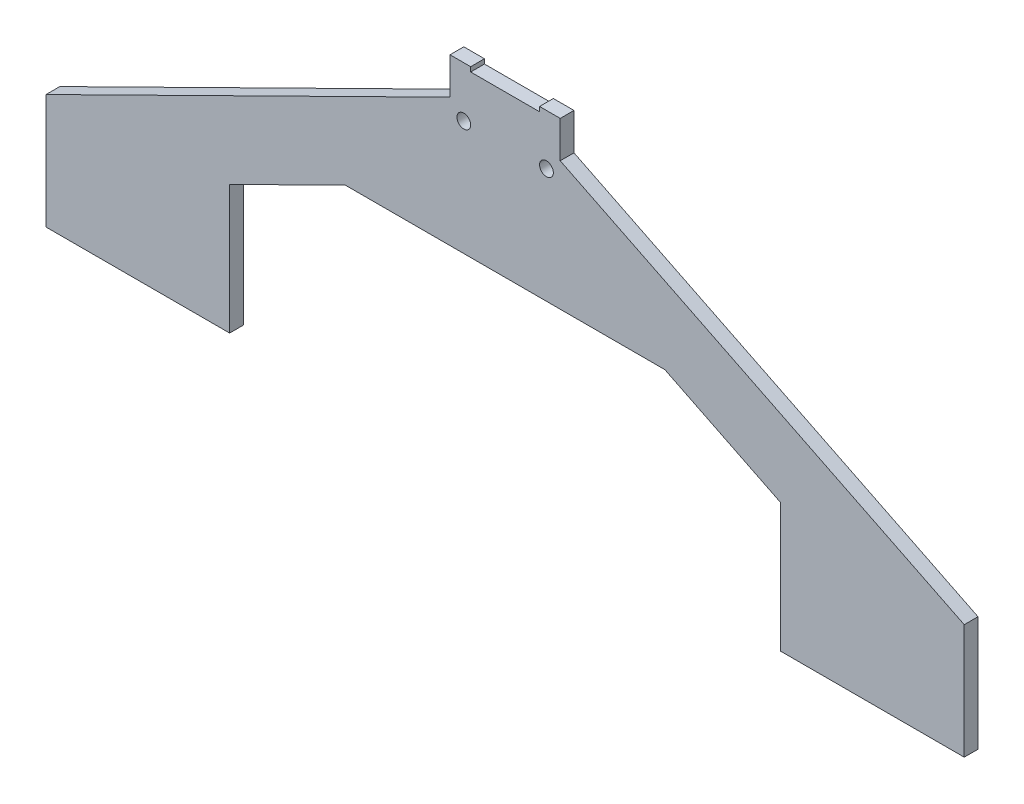
ISO-10303-21;
HEADER;
FILE_DESCRIPTION(('STEP AP214'),'2;1');
FILE_NAME('part.step','',(''),(''),'','','');
FILE_SCHEMA(('AUTOMOTIVE_DESIGN { 1 0 10303 214 1 1 1 1 }'));
ENDSEC;
DATA;
#1=APPLICATION_CONTEXT('core data for automotive mechanical design processes');
#2=APPLICATION_PROTOCOL_DEFINITION('international standard','automotive_design',2000,#1);
#3=PRODUCT_CONTEXT('',#1,'mechanical');
#4=PRODUCT('Part','Part','',(#3));
#5=PRODUCT_RELATED_PRODUCT_CATEGORY('part','',(#4));
#6=PRODUCT_DEFINITION_FORMATION('','',#4);
#7=PRODUCT_DEFINITION_CONTEXT('part definition',#1,'design');
#8=PRODUCT_DEFINITION('design','',#6,#7);
#9=PRODUCT_DEFINITION_SHAPE('','',#8);
#10=(LENGTH_UNIT() NAMED_UNIT(*) SI_UNIT(.MILLI.,.METRE.));
#11=(NAMED_UNIT(*) PLANE_ANGLE_UNIT() SI_UNIT($,.RADIAN.));
#12=(NAMED_UNIT(*) SI_UNIT($,.STERADIAN.) SOLID_ANGLE_UNIT());
#13=UNCERTAINTY_MEASURE_WITH_UNIT(LENGTH_MEASURE(1.E-05),#10,'distance_accuracy_value','');
#14=(GEOMETRIC_REPRESENTATION_CONTEXT(3) GLOBAL_UNCERTAINTY_ASSIGNED_CONTEXT((#13)) GLOBAL_UNIT_ASSIGNED_CONTEXT((#10,
#11,#12)) REPRESENTATION_CONTEXT('',''));
#15=CARTESIAN_POINT('',(0.,0.,0.));
#16=DIRECTION('',(0.,0.,1.));
#17=DIRECTION('',(1.,0.,0.));
#18=AXIS2_PLACEMENT_3D('',#15,#16,#17);
#19=CARTESIAN_POINT('',(-7.50000000000006,0.999999999991008,-3030.98121824954));
#20=DIRECTION('',(-1.,0.,0.));
#21=DIRECTION('',(0.,-1.,0.));
#22=AXIS2_PLACEMENT_3D('',#19,#20,#21);
#23=PLANE('',#22);
#24=DIRECTION('',(0.,1.,0.));
#25=VECTOR('',#24,1.);
#26=CARTESIAN_POINT('',(-7.50000000000006,0.999999999991008,-3033.98121824954));
#27=LINE('',#26,#25);
#28=CARTESIAN_POINT('',(-7.50000000000012,-8.88178419700125E-12,-3033.98121824954));
#29=VERTEX_POINT('',#28);
#30=CARTESIAN_POINT('',(-7.50000000000006,0.999999999991008,-3033.98121824954));
#31=VERTEX_POINT('',#30);
#32=EDGE_CURVE('E191',#29,#31,#27,.T.);
#33=ORIENTED_EDGE('',*,*,#32,.T.);
#34=DIRECTION('',(0.,0.,-1.));
#35=VECTOR('',#34,1.);
#36=CARTESIAN_POINT('',(-7.50000000000006,0.999999999991008,-3030.98121824954));
#37=LINE('',#36,#35);
#38=CARTESIAN_POINT('',(-7.50000000000006,0.999999999991008,-3030.98121824954));
#39=VERTEX_POINT('',#38);
#40=EDGE_CURVE('E11',#39,#31,#37,.T.);
#41=ORIENTED_EDGE('',*,*,#40,.F.);
#42=DIRECTION('',(0.,1.,0.));
#43=VECTOR('',#42,1.);
#44=CARTESIAN_POINT('',(-7.50000000000006,0.999999999991008,-3030.98121824954));
#45=LINE('',#44,#43);
#46=CARTESIAN_POINT('',(-7.50000000000012,-8.88178419700125E-12,-3030.98121824954));
#47=VERTEX_POINT('',#46);
#48=EDGE_CURVE('E226',#47,#39,#45,.T.);
#49=ORIENTED_EDGE('',*,*,#48,.F.);
#50=DIRECTION('',(0.,0.,-1.));
#51=VECTOR('',#50,1.);
#52=CARTESIAN_POINT('',(-7.50000000000012,-8.88178419700125E-12,-3030.98121824954));
#53=LINE('',#52,#51);
#54=EDGE_CURVE('E187',#47,#29,#53,.T.);
#55=ORIENTED_EDGE('',*,*,#54,.T.);
#56=EDGE_LOOP('',(#33,#41,#49,#55));
#57=FACE_BOUND('',#56,.T.);
#58=ADVANCED_FACE('F35',(#57),#23,.F.);
#59=CARTESIAN_POINT('',(-12.0000000000002,0.999999999991008,-3030.98121824954));
#60=DIRECTION('',(0.,-1.,0.));
#61=DIRECTION('',(0.,0.,-1.));
#62=AXIS2_PLACEMENT_3D('',#59,#60,#61);
#63=PLANE('',#62);
#64=DIRECTION('',(-1.,0.,0.));
#65=VECTOR('',#64,1.);
#66=CARTESIAN_POINT('',(-12.0000000000002,0.999999999991008,-3033.98121824954));
#67=LINE('',#66,#65);
#68=CARTESIAN_POINT('',(-12.0000000000002,0.999999999991008,-3033.98121824954));
#69=VERTEX_POINT('',#68);
#70=EDGE_CURVE('E194',#31,#69,#67,.T.);
#71=ORIENTED_EDGE('',*,*,#70,.T.);
#72=DIRECTION('',(0.,0.,-1.));
#73=VECTOR('',#72,1.);
#74=CARTESIAN_POINT('',(-12.0000000000002,0.999999999991008,-3030.98121824954));
#75=LINE('',#74,#73);
#76=CARTESIAN_POINT('',(-12.0000000000002,0.999999999991008,-3030.98121824954));
#77=VERTEX_POINT('',#76);
#78=EDGE_CURVE('E43',#77,#69,#75,.T.);
#79=ORIENTED_EDGE('',*,*,#78,.F.);
#80=DIRECTION('',(-1.,0.,0.));
#81=VECTOR('',#80,1.);
#82=CARTESIAN_POINT('',(-12.0000000000002,0.999999999991008,-3030.98121824954));
#83=LINE('',#82,#81);
#84=EDGE_CURVE('E124',#39,#77,#83,.T.);
#85=ORIENTED_EDGE('',*,*,#84,.F.);
#86=ORIENTED_EDGE('',*,*,#40,.T.);
#87=EDGE_LOOP('',(#71,#79,#85,#86));
#88=FACE_BOUND('',#87,.T.);
#89=ADVANCED_FACE('F335',(#88),#63,.F.);
#90=CARTESIAN_POINT('',(-12.0000000000002,0.999999999991008,-3030.98121824954));
#91=DIRECTION('',(1.,0.,0.));
#92=DIRECTION('',(0.,0.,-1.));
#93=AXIS2_PLACEMENT_3D('',#90,#91,#92);
#94=PLANE('',#93);
#95=DIRECTION('',(0.,-1.,0.));
#96=VECTOR('',#95,1.);
#97=CARTESIAN_POINT('',(-12.0000000000002,0.999999999991008,-3033.98121824954));
#98=LINE('',#97,#96);
#99=CARTESIAN_POINT('',(-12.0000000000002,-7.000000000009,-3033.98121824954));
#100=VERTEX_POINT('',#99);
#101=EDGE_CURVE('E197',#69,#100,#98,.T.);
#102=ORIENTED_EDGE('',*,*,#101,.T.);
#103=DIRECTION('',(0.,0.,-1.));
#104=VECTOR('',#103,1.);
#105=CARTESIAN_POINT('',(-12.0000000000002,-7.000000000009,-3030.98121824954));
#106=LINE('',#105,#104);
#107=CARTESIAN_POINT('',(-12.0000000000002,-7.000000000009,-3030.98121824954));
#108=VERTEX_POINT('',#107);
#109=EDGE_CURVE('E263',#108,#100,#106,.T.);
#110=ORIENTED_EDGE('',*,*,#109,.F.);
#111=DIRECTION('',(0.,-1.,0.));
#112=VECTOR('',#111,1.);
#113=CARTESIAN_POINT('',(-12.0000000000002,0.999999999991008,-3030.98121824954));
#114=LINE('',#113,#112);
#115=EDGE_CURVE('E271',#77,#108,#114,.T.);
#116=ORIENTED_EDGE('',*,*,#115,.F.);
#117=ORIENTED_EDGE('',*,*,#78,.T.);
#118=EDGE_LOOP('',(#102,#110,#116,#117));
#119=FACE_BOUND('',#118,.T.);
#120=ADVANCED_FACE('F269',(#119),#94,.F.);
#121=CARTESIAN_POINT('',(-12.0000000000002,-7.000000000009,-3030.98121824954));
#122=DIRECTION('',(0.443134157673178,-0.896455307476777,0.));
#123=DIRECTION('',(0.896455307476777,0.443134157673178,0.));
#124=AXIS2_PLACEMENT_3D('',#121,#122,#123);
#125=PLANE('',#124);
#126=DIRECTION('',(-0.896455307476777,-0.443134157673178,0.));
#127=VECTOR('',#126,1.);
#128=CARTESIAN_POINT('',(-12.0000000000002,-7.000000000009,-3033.98121824954));
#129=LINE('',#128,#127);
#130=CARTESIAN_POINT('',(-100.,-50.5000000000089,-3033.98121824954));
#131=VERTEX_POINT('',#130);
#132=EDGE_CURVE('E199',#100,#131,#129,.T.);
#133=ORIENTED_EDGE('',*,*,#132,.T.);
#134=DIRECTION('',(0.,0.,-1.));
#135=VECTOR('',#134,1.);
#136=CARTESIAN_POINT('',(-100.,-50.5000000000089,-3030.98121824954));
#137=LINE('',#136,#135);
#138=CARTESIAN_POINT('',(-100.,-50.5000000000089,-3030.98121824954));
#139=VERTEX_POINT('',#138);
#140=EDGE_CURVE('E260',#139,#131,#137,.T.);
#141=ORIENTED_EDGE('',*,*,#140,.F.);
#142=DIRECTION('',(-0.896455307476777,-0.443134157673178,0.));
#143=VECTOR('',#142,1.);
#144=CARTESIAN_POINT('',(-12.0000000000002,-7.000000000009,-3030.98121824954));
#145=LINE('',#144,#143);
#146=EDGE_CURVE('E289',#108,#139,#145,.T.);
#147=ORIENTED_EDGE('',*,*,#146,.F.);
#148=ORIENTED_EDGE('',*,*,#109,.T.);
#149=EDGE_LOOP('',(#133,#141,#147,#148));
#150=FACE_BOUND('',#149,.T.);
#151=ADVANCED_FACE('F280',(#150),#125,.F.);
#152=CARTESIAN_POINT('',(-100.,-50.5000000000089,-3030.98121824954));
#153=DIRECTION('',(1.,0.,0.));
#154=DIRECTION('',(0.,0.,-1.));
#155=AXIS2_PLACEMENT_3D('',#152,#153,#154);
#156=PLANE('',#155);
#157=DIRECTION('',(0.,-1.,0.));
#158=VECTOR('',#157,1.);
#159=CARTESIAN_POINT('',(-100.,-50.5000000000089,-3033.98121824954));
#160=LINE('',#159,#158);
#161=CARTESIAN_POINT('',(-100.,-75.5000000000088,-3033.98121824954));
#162=VERTEX_POINT('',#161);
#163=EDGE_CURVE('E201',#131,#162,#160,.T.);
#164=ORIENTED_EDGE('',*,*,#163,.T.);
#165=DIRECTION('',(0.,0.,-1.));
#166=VECTOR('',#165,1.);
#167=CARTESIAN_POINT('',(-100.,-75.5000000000088,-3030.98121824954));
#168=LINE('',#167,#166);
#169=CARTESIAN_POINT('',(-100.,-75.5000000000088,-3030.98121824954));
#170=VERTEX_POINT('',#169);
#171=EDGE_CURVE('E257',#170,#162,#168,.T.);
#172=ORIENTED_EDGE('',*,*,#171,.F.);
#173=DIRECTION('',(0.,-1.,0.));
#174=VECTOR('',#173,1.);
#175=CARTESIAN_POINT('',(-100.,-50.5000000000089,-3030.98121824954));
#176=LINE('',#175,#174);
#177=EDGE_CURVE('E286',#139,#170,#176,.T.);
#178=ORIENTED_EDGE('',*,*,#177,.F.);
#179=ORIENTED_EDGE('',*,*,#140,.T.);
#180=EDGE_LOOP('',(#164,#172,#178,#179));
#181=FACE_BOUND('',#180,.T.);
#182=ADVANCED_FACE('F284',(#181),#156,.F.);
#183=CARTESIAN_POINT('',(-100.,-75.5000000000088,-3030.98121824954));
#184=DIRECTION('',(0.,1.,0.));
#185=DIRECTION('',(-1.,0.,0.));
#186=AXIS2_PLACEMENT_3D('',#183,#184,#185);
#187=PLANE('',#186);
#188=DIRECTION('',(1.,0.,0.));
#189=VECTOR('',#188,1.);
#190=CARTESIAN_POINT('',(-100.,-75.5000000000088,-3033.98121824954));
#191=LINE('',#190,#189);
#192=CARTESIAN_POINT('',(-60.0000000000001,-75.5000000000092,-3033.98121824954));
#193=VERTEX_POINT('',#192);
#194=EDGE_CURVE('E203',#162,#193,#191,.T.);
#195=ORIENTED_EDGE('',*,*,#194,.T.);
#196=DIRECTION('',(0.,0.,-1.));
#197=VECTOR('',#196,1.);
#198=CARTESIAN_POINT('',(-60.0000000000001,-75.5000000000092,-3030.98121824954));
#199=LINE('',#198,#197);
#200=CARTESIAN_POINT('',(-60.0000000000001,-75.5000000000092,-3030.98121824954));
#201=VERTEX_POINT('',#200);
#202=EDGE_CURVE('E254',#201,#193,#199,.T.);
#203=ORIENTED_EDGE('',*,*,#202,.F.);
#204=DIRECTION('',(1.,0.,0.));
#205=VECTOR('',#204,1.);
#206=CARTESIAN_POINT('',(-100.,-75.5000000000088,-3030.98121824954));
#207=LINE('',#206,#205);
#208=EDGE_CURVE('E288',#170,#201,#207,.T.);
#209=ORIENTED_EDGE('',*,*,#208,.F.);
#210=ORIENTED_EDGE('',*,*,#171,.T.);
#211=EDGE_LOOP('',(#195,#203,#209,#210));
#212=FACE_BOUND('',#211,.T.);
#213=ADVANCED_FACE('F348',(#212),#187,.F.);
#214=CARTESIAN_POINT('',(-60.0000000000001,-75.5000000000092,-3030.98121824954));
#215=DIRECTION('',(-1.,0.,0.));
#216=DIRECTION('',(0.,-1.,0.));
#217=AXIS2_PLACEMENT_3D('',#214,#215,#216);
#218=PLANE('',#217);
#219=DIRECTION('',(0.,1.,0.));
#220=VECTOR('',#219,1.);
#221=CARTESIAN_POINT('',(-60.0000000000001,-75.5000000000092,-3033.98121824954));
#222=LINE('',#221,#220);
#223=CARTESIAN_POINT('',(-60.0000000000001,-47.4598414062668,-3033.98121824954));
#224=VERTEX_POINT('',#223);
#225=EDGE_CURVE('E205',#193,#224,#222,.T.);
#226=ORIENTED_EDGE('',*,*,#225,.T.);
#227=DIRECTION('',(0.,0.,-1.));
#228=VECTOR('',#227,1.);
#229=CARTESIAN_POINT('',(-60.0000000000001,-47.4598414062668,-3030.98121824954));
#230=LINE('',#229,#228);
#231=CARTESIAN_POINT('',(-60.0000000000001,-47.4598414062668,-3030.98121824954));
#232=VERTEX_POINT('',#231);
#233=EDGE_CURVE('E251',#232,#224,#230,.T.);
#234=ORIENTED_EDGE('',*,*,#233,.F.);
#235=DIRECTION('',(0.,1.,0.));
#236=VECTOR('',#235,1.);
#237=CARTESIAN_POINT('',(-60.0000000000001,-75.5000000000092,-3030.98121824954));
#238=LINE('',#237,#236);
#239=EDGE_CURVE('E291',#201,#232,#238,.T.);
#240=ORIENTED_EDGE('',*,*,#239,.F.);
#241=ORIENTED_EDGE('',*,*,#202,.T.);
#242=EDGE_LOOP('',(#226,#234,#240,#241));
#243=FACE_BOUND('',#242,.T.);
#244=ADVANCED_FACE('F351',(#243),#218,.F.);
#245=CARTESIAN_POINT('',(-60.0000000000001,-47.4598414062668,-3030.98121824954));
#246=DIRECTION('',(-0.443134157673177,0.896455307476778,0.));
#247=DIRECTION('',(-0.896455307476778,-0.443134157673177,0.));
#248=AXIS2_PLACEMENT_3D('',#245,#246,#247);
#249=PLANE('',#248);
#250=DIRECTION('',(0.896455307476778,0.443134157673177,0.));
#251=VECTOR('',#250,1.);
#252=CARTESIAN_POINT('',(-60.0000000000001,-47.4598414062668,-3033.98121824954));
#253=LINE('',#252,#251);
#254=CARTESIAN_POINT('',(-34.7938840516993,-35.0000000000046,-3033.98121824954));
#255=VERTEX_POINT('',#254);
#256=EDGE_CURVE('E207',#224,#255,#253,.T.);
#257=ORIENTED_EDGE('',*,*,#256,.T.);
#258=DIRECTION('',(0.,0.,-1.));
#259=VECTOR('',#258,1.);
#260=CARTESIAN_POINT('',(-34.7938840516993,-35.0000000000046,-3030.98121824954));
#261=LINE('',#260,#259);
#262=CARTESIAN_POINT('',(-34.7938840516993,-35.0000000000046,-3030.98121824954));
#263=VERTEX_POINT('',#262);
#264=EDGE_CURVE('E248',#263,#255,#261,.T.);
#265=ORIENTED_EDGE('',*,*,#264,.F.);
#266=DIRECTION('',(0.896455307476778,0.443134157673177,0.));
#267=VECTOR('',#266,1.);
#268=CARTESIAN_POINT('',(-60.0000000000001,-47.4598414062668,-3030.98121824954));
#269=LINE('',#268,#267);
#270=EDGE_CURVE('E297',#232,#263,#269,.T.);
#271=ORIENTED_EDGE('',*,*,#270,.F.);
#272=ORIENTED_EDGE('',*,*,#233,.T.);
#273=EDGE_LOOP('',(#257,#265,#271,#272));
#274=FACE_BOUND('',#273,.T.);
#275=ADVANCED_FACE('F355',(#274),#249,.F.);
#276=CARTESIAN_POINT('',(-34.7938840516993,-35.0000000000046,-3030.98121824954));
#277=DIRECTION('',(0.,1.,0.));
#278=DIRECTION('',(-1.,0.,0.));
#279=AXIS2_PLACEMENT_3D('',#276,#277,#278);
#280=PLANE('',#279);
#281=DIRECTION('',(1.,0.,0.));
#282=VECTOR('',#281,1.);
#283=CARTESIAN_POINT('',(-34.7938840516993,-35.0000000000046,-3033.98121824954));
#284=LINE('',#283,#282);
#285=CARTESIAN_POINT('',(34.7938840516853,-34.9999999999993,-3033.98121824954));
#286=VERTEX_POINT('',#285);
#287=EDGE_CURVE('E209',#255,#286,#284,.T.);
#288=ORIENTED_EDGE('',*,*,#287,.T.);
#289=DIRECTION('',(0.,0.,-1.));
#290=VECTOR('',#289,1.);
#291=CARTESIAN_POINT('',(34.7938840516853,-34.9999999999993,-3030.98121824954));
#292=LINE('',#291,#290);
#293=CARTESIAN_POINT('',(34.7938840516853,-34.9999999999993,-3030.98121824954));
#294=VERTEX_POINT('',#293);
#295=EDGE_CURVE('E245',#294,#286,#292,.T.);
#296=ORIENTED_EDGE('',*,*,#295,.F.);
#297=DIRECTION('',(1.,0.,0.));
#298=VECTOR('',#297,1.);
#299=CARTESIAN_POINT('',(-34.7938840516993,-35.0000000000046,-3030.98121824954));
#300=LINE('',#299,#298);
#301=EDGE_CURVE('E299',#263,#294,#300,.T.);
#302=ORIENTED_EDGE('',*,*,#301,.F.);
#303=ORIENTED_EDGE('',*,*,#264,.T.);
#304=EDGE_LOOP('',(#288,#296,#302,#303));
#305=FACE_BOUND('',#304,.T.);
#306=ADVANCED_FACE('F359',(#305),#280,.F.);
#307=CARTESIAN_POINT('',(59.9999999999999,-47.4598414062708,-3030.98121824954));
#308=DIRECTION('',(0.443134157673247,0.896455307476743,0.));
#309=DIRECTION('',(-0.896455307476743,0.443134157673247,0.));
#310=AXIS2_PLACEMENT_3D('',#307,#308,#309);
#311=PLANE('',#310);
#312=DIRECTION('',(0.896455307476743,-0.443134157673247,0.));
#313=VECTOR('',#312,1.);
#314=CARTESIAN_POINT('',(59.9999999999999,-47.4598414062708,-3033.98121824954));
#315=LINE('',#314,#313);
#316=CARTESIAN_POINT('',(59.9999999999999,-47.4598414062708,-3033.98121824954));
#317=VERTEX_POINT('',#316);
#318=EDGE_CURVE('E211',#286,#317,#315,.T.);
#319=ORIENTED_EDGE('',*,*,#318,.T.);
#320=DIRECTION('',(0.,0.,-1.));
#321=VECTOR('',#320,1.);
#322=CARTESIAN_POINT('',(59.9999999999999,-47.4598414062708,-3030.98121824954));
#323=LINE('',#322,#321);
#324=CARTESIAN_POINT('',(59.9999999999999,-47.4598414062708,-3030.98121824954));
#325=VERTEX_POINT('',#324);
#326=EDGE_CURVE('E242',#325,#317,#323,.T.);
#327=ORIENTED_EDGE('',*,*,#326,.F.);
#328=DIRECTION('',(0.896455307476743,-0.443134157673247,0.));
#329=VECTOR('',#328,1.);
#330=CARTESIAN_POINT('',(59.9999999999999,-47.4598414062708,-3030.98121824954));
#331=LINE('',#330,#329);
#332=EDGE_CURVE('E301',#294,#325,#331,.T.);
#333=ORIENTED_EDGE('',*,*,#332,.F.);
#334=ORIENTED_EDGE('',*,*,#295,.T.);
#335=EDGE_LOOP('',(#319,#327,#333,#334));
#336=FACE_BOUND('',#335,.T.);
#337=ADVANCED_FACE('F363',(#336),#311,.F.);
#338=CARTESIAN_POINT('',(59.9999999999999,-75.5000000000092,-3030.98121824954));
#339=DIRECTION('',(1.,0.,0.));
#340=DIRECTION('',(0.,0.,-1.));
#341=AXIS2_PLACEMENT_3D('',#338,#339,#340);
#342=PLANE('',#341);
#343=DIRECTION('',(0.,-1.,0.));
#344=VECTOR('',#343,1.);
#345=CARTESIAN_POINT('',(59.9999999999999,-75.5000000000092,-3033.98121824954));
#346=LINE('',#345,#344);
#347=CARTESIAN_POINT('',(59.9999999999999,-75.5000000000092,-3033.98121824954));
#348=VERTEX_POINT('',#347);
#349=EDGE_CURVE('E213',#317,#348,#346,.T.);
#350=ORIENTED_EDGE('',*,*,#349,.T.);
#351=DIRECTION('',(0.,0.,-1.));
#352=VECTOR('',#351,1.);
#353=CARTESIAN_POINT('',(59.9999999999999,-75.5000000000092,-3030.98121824954));
#354=LINE('',#353,#352);
#355=CARTESIAN_POINT('',(59.9999999999999,-75.5000000000092,-3030.98121824954));
#356=VERTEX_POINT('',#355);
#357=EDGE_CURVE('E239',#356,#348,#354,.T.);
#358=ORIENTED_EDGE('',*,*,#357,.F.);
#359=DIRECTION('',(0.,-1.,0.));
#360=VECTOR('',#359,1.);
#361=CARTESIAN_POINT('',(59.9999999999999,-75.5000000000092,-3030.98121824954));
#362=LINE('',#361,#360);
#363=EDGE_CURVE('E303',#325,#356,#362,.T.);
#364=ORIENTED_EDGE('',*,*,#363,.F.);
#365=ORIENTED_EDGE('',*,*,#326,.T.);
#366=EDGE_LOOP('',(#350,#358,#364,#365));
#367=FACE_BOUND('',#366,.T.);
#368=ADVANCED_FACE('F367',(#367),#342,.F.);
#369=CARTESIAN_POINT('',(99.9999999999999,-75.5000000000088,-3030.98121824954));
#370=DIRECTION('',(0.,1.,0.));
#371=DIRECTION('',(-1.,0.,0.));
#372=AXIS2_PLACEMENT_3D('',#369,#370,#371);
#373=PLANE('',#372);
#374=DIRECTION('',(1.,0.,0.));
#375=VECTOR('',#374,1.);
#376=CARTESIAN_POINT('',(99.9999999999999,-75.5000000000088,-3033.98121824954));
#377=LINE('',#376,#375);
#378=CARTESIAN_POINT('',(99.9999999999999,-75.5000000000088,-3033.98121824954));
#379=VERTEX_POINT('',#378);
#380=EDGE_CURVE('E215',#348,#379,#377,.T.);
#381=ORIENTED_EDGE('',*,*,#380,.T.);
#382=DIRECTION('',(0.,0.,-1.));
#383=VECTOR('',#382,1.);
#384=CARTESIAN_POINT('',(99.9999999999999,-75.5000000000088,-3030.98121824954));
#385=LINE('',#384,#383);
#386=CARTESIAN_POINT('',(99.9999999999999,-75.5000000000088,-3030.98121824954));
#387=VERTEX_POINT('',#386);
#388=EDGE_CURVE('E236',#387,#379,#385,.T.);
#389=ORIENTED_EDGE('',*,*,#388,.F.);
#390=DIRECTION('',(1.,0.,0.));
#391=VECTOR('',#390,1.);
#392=CARTESIAN_POINT('',(99.9999999999999,-75.5000000000088,-3030.98121824954));
#393=LINE('',#392,#391);
#394=EDGE_CURVE('E305',#356,#387,#393,.T.);
#395=ORIENTED_EDGE('',*,*,#394,.F.);
#396=ORIENTED_EDGE('',*,*,#357,.T.);
#397=EDGE_LOOP('',(#381,#389,#395,#396));
#398=FACE_BOUND('',#397,.T.);
#399=ADVANCED_FACE('F371',(#398),#373,.F.);
#400=CARTESIAN_POINT('',(99.9999999999999,-50.5000000000089,-3030.98121824954));
#401=DIRECTION('',(-1.,0.,0.));
#402=DIRECTION('',(0.,0.,1.));
#403=AXIS2_PLACEMENT_3D('',#400,#401,#402);
#404=PLANE('',#403);
#405=DIRECTION('',(0.,1.,0.));
#406=VECTOR('',#405,1.);
#407=CARTESIAN_POINT('',(99.9999999999999,-50.5000000000089,-3033.98121824954));
#408=LINE('',#407,#406);
#409=CARTESIAN_POINT('',(99.9999999999999,-50.5000000000089,-3033.98121824954));
#410=VERTEX_POINT('',#409);
#411=EDGE_CURVE('E217',#379,#410,#408,.T.);
#412=ORIENTED_EDGE('',*,*,#411,.T.);
#413=DIRECTION('',(0.,0.,-1.));
#414=VECTOR('',#413,1.);
#415=CARTESIAN_POINT('',(99.9999999999999,-50.5000000000089,-3030.98121824954));
#416=LINE('',#415,#414);
#417=CARTESIAN_POINT('',(99.9999999999999,-50.5000000000089,-3030.98121824954));
#418=VERTEX_POINT('',#417);
#419=EDGE_CURVE('E233',#418,#410,#416,.T.);
#420=ORIENTED_EDGE('',*,*,#419,.F.);
#421=DIRECTION('',(0.,1.,0.));
#422=VECTOR('',#421,1.);
#423=CARTESIAN_POINT('',(99.9999999999999,-50.5000000000089,-3030.98121824954));
#424=LINE('',#423,#422);
#425=EDGE_CURVE('E307',#387,#418,#424,.T.);
#426=ORIENTED_EDGE('',*,*,#425,.F.);
#427=ORIENTED_EDGE('',*,*,#388,.T.);
#428=EDGE_LOOP('',(#412,#420,#426,#427));
#429=FACE_BOUND('',#428,.T.);
#430=ADVANCED_FACE('F375',(#429),#404,.F.);
#431=CARTESIAN_POINT('',(12.,-7.000000000009,-3030.98121824954));
#432=DIRECTION('',(-0.443134157673178,-0.896455307476777,0.));
#433=DIRECTION('',(0.896455307476777,-0.443134157673178,0.));
#434=AXIS2_PLACEMENT_3D('',#431,#432,#433);
#435=PLANE('',#434);
#436=DIRECTION('',(-0.896455307476777,0.443134157673178,0.));
#437=VECTOR('',#436,1.);
#438=CARTESIAN_POINT('',(12.,-7.000000000009,-3033.98121824954));
#439=LINE('',#438,#437);
#440=CARTESIAN_POINT('',(12.,-7.000000000009,-3033.98121824954));
#441=VERTEX_POINT('',#440);
#442=EDGE_CURVE('E219',#410,#441,#439,.T.);
#443=ORIENTED_EDGE('',*,*,#442,.T.);
#444=DIRECTION('',(0.,0.,-1.));
#445=VECTOR('',#444,1.);
#446=CARTESIAN_POINT('',(12.,-7.000000000009,-3030.98121824954));
#447=LINE('',#446,#445);
#448=CARTESIAN_POINT('',(12.,-7.000000000009,-3030.98121824954));
#449=VERTEX_POINT('',#448);
#450=EDGE_CURVE('E230',#449,#441,#447,.T.);
#451=ORIENTED_EDGE('',*,*,#450,.F.);
#452=DIRECTION('',(-0.896455307476777,0.443134157673178,0.));
#453=VECTOR('',#452,1.);
#454=CARTESIAN_POINT('',(12.,-7.000000000009,-3030.98121824954));
#455=LINE('',#454,#453);
#456=EDGE_CURVE('E309',#418,#449,#455,.T.);
#457=ORIENTED_EDGE('',*,*,#456,.F.);
#458=ORIENTED_EDGE('',*,*,#419,.T.);
#459=EDGE_LOOP('',(#443,#451,#457,#458));
#460=FACE_BOUND('',#459,.T.);
#461=ADVANCED_FACE('F315',(#460),#435,.F.);
#462=CARTESIAN_POINT('',(12.,0.999999999991008,-3030.98121824954));
#463=DIRECTION('',(-1.,0.,0.));
#464=DIRECTION('',(0.,0.,1.));
#465=AXIS2_PLACEMENT_3D('',#462,#463,#464);
#466=PLANE('',#465);
#467=DIRECTION('',(0.,1.,0.));
#468=VECTOR('',#467,1.);
#469=CARTESIAN_POINT('',(12.,0.999999999991008,-3033.98121824954));
#470=LINE('',#469,#468);
#471=CARTESIAN_POINT('',(12.,0.999999999991008,-3033.98121824954));
#472=VERTEX_POINT('',#471);
#473=EDGE_CURVE('E221',#441,#472,#470,.T.);
#474=ORIENTED_EDGE('',*,*,#473,.T.);
#475=DIRECTION('',(0.,0.,-1.));
#476=VECTOR('',#475,1.);
#477=CARTESIAN_POINT('',(12.,0.999999999991008,-3030.98121824954));
#478=LINE('',#477,#476);
#479=CARTESIAN_POINT('',(12.,0.999999999991008,-3030.98121824954));
#480=VERTEX_POINT('',#479);
#481=EDGE_CURVE('E182',#480,#472,#478,.T.);
#482=ORIENTED_EDGE('',*,*,#481,.F.);
#483=DIRECTION('',(0.,1.,0.));
#484=VECTOR('',#483,1.);
#485=CARTESIAN_POINT('',(12.,0.999999999991008,-3030.98121824954));
#486=LINE('',#485,#484);
#487=EDGE_CURVE('E173',#449,#480,#486,.T.);
#488=ORIENTED_EDGE('',*,*,#487,.F.);
#489=ORIENTED_EDGE('',*,*,#450,.T.);
#490=EDGE_LOOP('',(#474,#482,#488,#489));
#491=FACE_BOUND('',#490,.T.);
#492=ADVANCED_FACE('F319',(#491),#466,.F.);
#493=CARTESIAN_POINT('',(7.49999999999984,0.999999999991008,-3030.98121824954));
#494=DIRECTION('',(0.,-1.,0.));
#495=DIRECTION('',(0.,0.,-1.));
#496=AXIS2_PLACEMENT_3D('',#493,#494,#495);
#497=PLANE('',#496);
#498=DIRECTION('',(-1.,0.,0.));
#499=VECTOR('',#498,1.);
#500=CARTESIAN_POINT('',(7.49999999999984,0.999999999991008,-3033.98121824954));
#501=LINE('',#500,#499);
#502=CARTESIAN_POINT('',(7.49999999999984,0.999999999991008,-3033.98121824954));
#503=VERTEX_POINT('',#502);
#504=EDGE_CURVE('E181',#472,#503,#501,.T.);
#505=ORIENTED_EDGE('',*,*,#504,.T.);
#506=DIRECTION('',(0.,0.,-1.));
#507=VECTOR('',#506,1.);
#508=CARTESIAN_POINT('',(7.49999999999984,0.999999999991008,-3030.98121824954));
#509=LINE('',#508,#507);
#510=CARTESIAN_POINT('',(7.49999999999984,0.999999999991008,-3030.98121824954));
#511=VERTEX_POINT('',#510);
#512=EDGE_CURVE('E178',#511,#503,#509,.T.);
#513=ORIENTED_EDGE('',*,*,#512,.F.);
#514=DIRECTION('',(-1.,0.,0.));
#515=VECTOR('',#514,1.);
#516=CARTESIAN_POINT('',(7.49999999999984,0.999999999991008,-3030.98121824954));
#517=LINE('',#516,#515);
#518=EDGE_CURVE('E167',#480,#511,#517,.T.);
#519=ORIENTED_EDGE('',*,*,#518,.F.);
#520=ORIENTED_EDGE('',*,*,#481,.T.);
#521=EDGE_LOOP('',(#505,#513,#519,#520));
#522=FACE_BOUND('',#521,.T.);
#523=ADVANCED_FACE('F179',(#522),#497,.F.);
#524=CARTESIAN_POINT('',(7.4999999999999,-8.88178419700125E-12,-3030.98121824954));
#525=DIRECTION('',(1.,0.,0.));
#526=DIRECTION('',(0.,1.,0.));
#527=AXIS2_PLACEMENT_3D('',#524,#525,#526);
#528=PLANE('',#527);
#529=DIRECTION('',(0.,-1.,0.));
#530=VECTOR('',#529,1.);
#531=CARTESIAN_POINT('',(7.4999999999999,-8.88178419700125E-12,-3033.98121824954));
#532=LINE('',#531,#530);
#533=CARTESIAN_POINT('',(7.4999999999999,-8.88178419700125E-12,-3033.98121824954));
#534=VERTEX_POINT('',#533);
#535=EDGE_CURVE('E110',#503,#534,#532,.T.);
#536=ORIENTED_EDGE('',*,*,#535,.T.);
#537=DIRECTION('',(0.,0.,-1.));
#538=VECTOR('',#537,1.);
#539=CARTESIAN_POINT('',(7.4999999999999,-8.88178419700125E-12,-3030.98121824954));
#540=LINE('',#539,#538);
#541=CARTESIAN_POINT('',(7.4999999999999,-8.88178419700125E-12,-3030.98121824954));
#542=VERTEX_POINT('',#541);
#543=EDGE_CURVE('E183',#542,#534,#540,.T.);
#544=ORIENTED_EDGE('',*,*,#543,.F.);
#545=DIRECTION('',(0.,-1.,0.));
#546=VECTOR('',#545,1.);
#547=CARTESIAN_POINT('',(7.4999999999999,-8.88178419700125E-12,-3030.98121824954));
#548=LINE('',#547,#546);
#549=EDGE_CURVE('E171',#511,#542,#548,.T.);
#550=ORIENTED_EDGE('',*,*,#549,.F.);
#551=ORIENTED_EDGE('',*,*,#512,.T.);
#552=EDGE_LOOP('',(#536,#544,#550,#551));
#553=FACE_BOUND('',#552,.T.);
#554=ADVANCED_FACE('F185',(#553),#528,.F.);
#555=CARTESIAN_POINT('',(-7.50000000000012,-8.88178419700125E-12,-3030.98121824954));
#556=DIRECTION('',(0.,-1.,0.));
#557=DIRECTION('',(0.,0.,-1.));
#558=AXIS2_PLACEMENT_3D('',#555,#556,#557);
#559=PLANE('',#558);
#560=DIRECTION('',(-1.,0.,0.));
#561=VECTOR('',#560,1.);
#562=CARTESIAN_POINT('',(-7.50000000000012,-8.88178419700125E-12,-3033.98121824954));
#563=LINE('',#562,#561);
#564=EDGE_CURVE('E116',#534,#29,#563,.T.);
#565=ORIENTED_EDGE('',*,*,#564,.T.);
#566=ORIENTED_EDGE('',*,*,#54,.F.);
#567=DIRECTION('',(-1.,0.,0.));
#568=VECTOR('',#567,1.);
#569=CARTESIAN_POINT('',(-7.50000000000012,-8.88178419700125E-12,-3030.98121824954));
#570=LINE('',#569,#568);
#571=EDGE_CURVE('E51',#542,#47,#570,.T.);
#572=ORIENTED_EDGE('',*,*,#571,.F.);
#573=ORIENTED_EDGE('',*,*,#543,.T.);
#574=EDGE_LOOP('',(#565,#566,#572,#573));
#575=FACE_BOUND('',#574,.T.);
#576=ADVANCED_FACE('F323',(#575),#559,.F.);
#577=CARTESIAN_POINT('',(0.,0.,-3030.98121824954));
#578=DIRECTION('',(0.,0.,1.));
#579=DIRECTION('',(1.,0.,0.));
#580=AXIS2_PLACEMENT_3D('',#577,#578,#579);
#581=PLANE('',#580);
#582=CARTESIAN_POINT('',(9.,-10.0000000000089,-3030.98121824954));
#583=DIRECTION('',(0.,0.,1.));
#584=DIRECTION('',(1.,0.,0.));
#585=AXIS2_PLACEMENT_3D('',#582,#583,#584);
#586=CIRCLE('',#585,1.50000000000257);
#587=CARTESIAN_POINT('',(10.5000000000026,-10.0000000000089,-3030.98121824954));
#588=VERTEX_POINT('',#587);
#589=EDGE_CURVE('E440',#588,#588,#586,.T.);
#590=ORIENTED_EDGE('',*,*,#589,.F.);
#591=EDGE_LOOP('',(#590));
#592=FACE_BOUND('',#591,.T.);
#593=CARTESIAN_POINT('',(-9.,-10.0000000000089,-3030.98121824954));
#594=DIRECTION('',(0.,0.,1.));
#595=DIRECTION('',(1.,0.,0.));
#596=AXIS2_PLACEMENT_3D('',#593,#594,#595);
#597=CIRCLE('',#596,1.50000000000255);
#598=CARTESIAN_POINT('',(-7.49999999999744,-10.0000000000089,-3030.98121824954));
#599=VERTEX_POINT('',#598);
#600=EDGE_CURVE('E445',#599,#599,#597,.T.);
#601=ORIENTED_EDGE('',*,*,#600,.F.);
#602=EDGE_LOOP('',(#601));
#603=FACE_BOUND('',#602,.T.);
#604=ORIENTED_EDGE('',*,*,#48,.T.);
#605=ORIENTED_EDGE('',*,*,#84,.T.);
#606=ORIENTED_EDGE('',*,*,#115,.T.);
#607=ORIENTED_EDGE('',*,*,#146,.T.);
#608=ORIENTED_EDGE('',*,*,#177,.T.);
#609=ORIENTED_EDGE('',*,*,#208,.T.);
#610=ORIENTED_EDGE('',*,*,#239,.T.);
#611=ORIENTED_EDGE('',*,*,#270,.T.);
#612=ORIENTED_EDGE('',*,*,#301,.T.);
#613=ORIENTED_EDGE('',*,*,#332,.T.);
#614=ORIENTED_EDGE('',*,*,#363,.T.);
#615=ORIENTED_EDGE('',*,*,#394,.T.);
#616=ORIENTED_EDGE('',*,*,#425,.T.);
#617=ORIENTED_EDGE('',*,*,#456,.T.);
#618=ORIENTED_EDGE('',*,*,#487,.T.);
#619=ORIENTED_EDGE('',*,*,#518,.T.);
#620=ORIENTED_EDGE('',*,*,#549,.T.);
#621=ORIENTED_EDGE('',*,*,#571,.T.);
#622=EDGE_LOOP('',(#604,#605,#606,#607,#608,#609,#610,#611,#612,#613,#614,#615,#616,#617,#618,
#619,#620,#621));
#623=FACE_BOUND('',#622,.T.);
#624=ADVANCED_FACE('F169',(#592,#603,#623),#581,.T.);
#625=CARTESIAN_POINT('',(0.,0.,-3033.98121824954));
#626=DIRECTION('',(0.,0.,1.));
#627=DIRECTION('',(1.,0.,0.));
#628=AXIS2_PLACEMENT_3D('',#625,#626,#627);
#629=PLANE('',#628);
#630=CARTESIAN_POINT('',(9.,-10.0000000000089,-3033.98121824954));
#631=DIRECTION('',(0.,0.,1.));
#632=DIRECTION('',(1.,0.,0.));
#633=AXIS2_PLACEMENT_3D('',#630,#631,#632);
#634=CIRCLE('',#633,1.50000000000257);
#635=CARTESIAN_POINT('',(10.5000000000026,-10.0000000000089,-3033.98121824954));
#636=VERTEX_POINT('',#635);
#637=EDGE_CURVE('E195',#636,#636,#634,.T.);
#638=ORIENTED_EDGE('',*,*,#637,.T.);
#639=EDGE_LOOP('',(#638));
#640=FACE_BOUND('',#639,.T.);
#641=CARTESIAN_POINT('',(-9.,-10.0000000000089,-3033.98121824954));
#642=DIRECTION('',(0.,0.,1.));
#643=DIRECTION('',(1.,0.,0.));
#644=AXIS2_PLACEMENT_3D('',#641,#642,#643);
#645=CIRCLE('',#644,1.50000000000255);
#646=CARTESIAN_POINT('',(-7.49999999999744,-10.0000000000089,-3033.98121824954));
#647=VERTEX_POINT('',#646);
#648=EDGE_CURVE('E441',#647,#647,#645,.T.);
#649=ORIENTED_EDGE('',*,*,#648,.T.);
#650=EDGE_LOOP('',(#649));
#651=FACE_BOUND('',#650,.T.);
#652=ORIENTED_EDGE('',*,*,#32,.F.);
#653=ORIENTED_EDGE('',*,*,#564,.F.);
#654=ORIENTED_EDGE('',*,*,#535,.F.);
#655=ORIENTED_EDGE('',*,*,#504,.F.);
#656=ORIENTED_EDGE('',*,*,#473,.F.);
#657=ORIENTED_EDGE('',*,*,#442,.F.);
#658=ORIENTED_EDGE('',*,*,#411,.F.);
#659=ORIENTED_EDGE('',*,*,#380,.F.);
#660=ORIENTED_EDGE('',*,*,#349,.F.);
#661=ORIENTED_EDGE('',*,*,#318,.F.);
#662=ORIENTED_EDGE('',*,*,#287,.F.);
#663=ORIENTED_EDGE('',*,*,#256,.F.);
#664=ORIENTED_EDGE('',*,*,#225,.F.);
#665=ORIENTED_EDGE('',*,*,#194,.F.);
#666=ORIENTED_EDGE('',*,*,#163,.F.);
#667=ORIENTED_EDGE('',*,*,#132,.F.);
#668=ORIENTED_EDGE('',*,*,#101,.F.);
#669=ORIENTED_EDGE('',*,*,#70,.F.);
#670=EDGE_LOOP('',(#652,#653,#654,#655,#656,#657,#658,#659,#660,#661,#662,#663,#664,#665,#666,
#667,#668,#669));
#671=FACE_BOUND('',#670,.T.);
#672=ADVANCED_FACE('F275',(#640,#651,#671),#629,.F.);
#673=CARTESIAN_POINT('',(-9.,-10.0000000000089,-3033.98121824954));
#674=DIRECTION('',(0.,0.,1.));
#675=DIRECTION('',(1.,0.,0.));
#676=AXIS2_PLACEMENT_3D('',#673,#674,#675);
#677=CYLINDRICAL_SURFACE('',#676,1.50000000000255);
#678=ORIENTED_EDGE('',*,*,#648,.F.);
#679=EDGE_LOOP('',(#678));
#680=FACE_BOUND('',#679,.T.);
#681=ORIENTED_EDGE('',*,*,#600,.T.);
#682=EDGE_LOOP('',(#681));
#683=FACE_BOUND('',#682,.T.);
#684=ADVANCED_FACE('F412',(#680,#683),#677,.F.);
#685=CARTESIAN_POINT('',(9.,-10.0000000000089,-3033.98121824954));
#686=DIRECTION('',(0.,0.,1.));
#687=DIRECTION('',(1.,0.,0.));
#688=AXIS2_PLACEMENT_3D('',#685,#686,#687);
#689=CYLINDRICAL_SURFACE('',#688,1.50000000000257);
#690=ORIENTED_EDGE('',*,*,#637,.F.);
#691=EDGE_LOOP('',(#690));
#692=FACE_BOUND('',#691,.T.);
#693=ORIENTED_EDGE('',*,*,#589,.T.);
#694=EDGE_LOOP('',(#693));
#695=FACE_BOUND('',#694,.T.);
#696=ADVANCED_FACE('F421',(#692,#695),#689,.F.);
#697=CLOSED_SHELL('',(#58,#89,#120,#151,#182,#213,#244,#275,#306,#337,#368,#399,#430,#461,#492,
#523,#554,#576,#624,#672,#684,#696));
#698=MANIFOLD_SOLID_BREP('B2',#697);
#699=ADVANCED_BREP_SHAPE_REPRESENTATION('',(#18,#698),#14);
#700=SHAPE_DEFINITION_REPRESENTATION(#9,#699);
ENDSEC;
END-ISO-10303-21;
